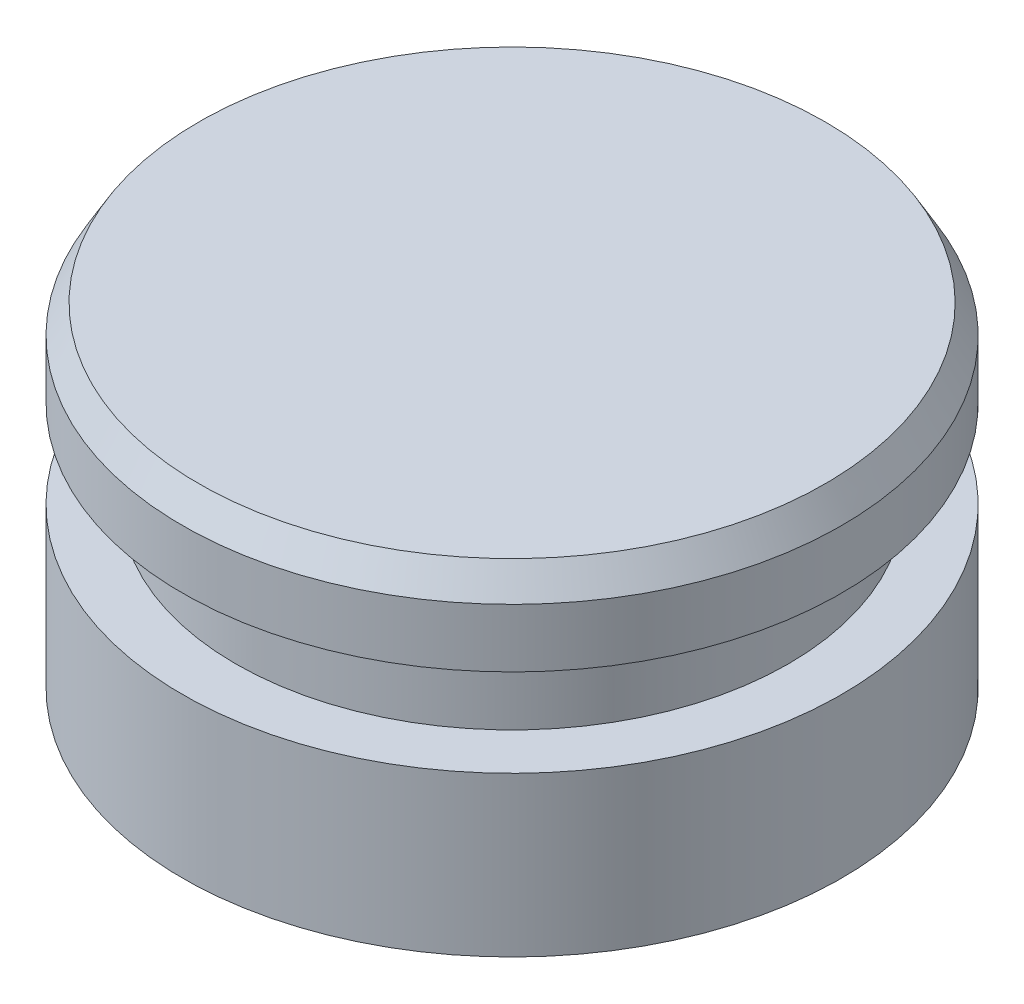
ISO-10303-21;
HEADER;
FILE_DESCRIPTION(('STEP AP214'),'2;1');
FILE_NAME('part.step','',(''),(''),'','','');
FILE_SCHEMA(('AUTOMOTIVE_DESIGN { 1 0 10303 214 1 1 1 1 }'));
ENDSEC;
DATA;
#1=APPLICATION_CONTEXT('core data for automotive mechanical design processes');
#2=APPLICATION_PROTOCOL_DEFINITION('international standard','automotive_design',2000,#1);
#3=PRODUCT_CONTEXT('',#1,'mechanical');
#4=PRODUCT('Part','Part','',(#3));
#5=PRODUCT_RELATED_PRODUCT_CATEGORY('part','',(#4));
#6=PRODUCT_DEFINITION_FORMATION('','',#4);
#7=PRODUCT_DEFINITION_CONTEXT('part definition',#1,'design');
#8=PRODUCT_DEFINITION('design','',#6,#7);
#9=PRODUCT_DEFINITION_SHAPE('','',#8);
#10=(LENGTH_UNIT() NAMED_UNIT(*) SI_UNIT(.MILLI.,.METRE.));
#11=(NAMED_UNIT(*) PLANE_ANGLE_UNIT() SI_UNIT($,.RADIAN.));
#12=(NAMED_UNIT(*) SI_UNIT($,.STERADIAN.) SOLID_ANGLE_UNIT());
#13=UNCERTAINTY_MEASURE_WITH_UNIT(LENGTH_MEASURE(1.E-05),#10,'distance_accuracy_value','');
#14=(GEOMETRIC_REPRESENTATION_CONTEXT(3) GLOBAL_UNCERTAINTY_ASSIGNED_CONTEXT((#13)) GLOBAL_UNIT_ASSIGNED_CONTEXT((#10,
#11,#12)) REPRESENTATION_CONTEXT('',''));
#15=CARTESIAN_POINT('',(0.,0.,0.));
#16=DIRECTION('',(0.,0.,1.));
#17=DIRECTION('',(1.,0.,0.));
#18=AXIS2_PLACEMENT_3D('',#15,#16,#17);
#19=CARTESIAN_POINT('',(0.,0.,0.));
#20=DIRECTION('',(0.,1.,0.));
#21=DIRECTION('',(0.,0.,1.));
#22=AXIS2_PLACEMENT_3D('',#19,#20,#21);
#23=PLANE('',#22);
#24=CARTESIAN_POINT('',(0.,0.,0.));
#25=DIRECTION('',(0.,-1.,0.));
#26=DIRECTION('',(0.,0.,-1.));
#27=AXIS2_PLACEMENT_3D('',#24,#25,#26);
#28=CIRCLE('',#27,9.5377);
#29=CARTESIAN_POINT('',(0.,0.,-9.5377));
#30=VERTEX_POINT('',#29);
#31=EDGE_CURVE('E43',#30,#30,#28,.T.);
#32=ORIENTED_EDGE('',*,*,#31,.T.);
#33=EDGE_LOOP('',(#32));
#34=FACE_BOUND('',#33,.T.);
#35=ADVANCED_FACE('F32',(#34),#23,.F.);
#36=CARTESIAN_POINT('',(0.,0.,0.));
#37=DIRECTION('',(0.,-1.,0.));
#38=DIRECTION('',(0.,0.,-1.));
#39=AXIS2_PLACEMENT_3D('',#36,#37,#38);
#40=CYLINDRICAL_SURFACE('',#39,9.5377);
#41=ORIENTED_EDGE('',*,*,#31,.F.);
#42=EDGE_LOOP('',(#41));
#43=FACE_BOUND('',#42,.T.);
#44=CARTESIAN_POINT('',(0.,4.60375,0.));
#45=DIRECTION('',(0.,-1.,0.));
#46=DIRECTION('',(0.,0.,-1.));
#47=AXIS2_PLACEMENT_3D('',#44,#45,#46);
#48=CIRCLE('',#47,9.5377);
#49=CARTESIAN_POINT('',(0.,4.60375,-9.5377));
#50=VERTEX_POINT('',#49);
#51=EDGE_CURVE('E47',#50,#50,#48,.T.);
#52=ORIENTED_EDGE('',*,*,#51,.T.);
#53=EDGE_LOOP('',(#52));
#54=FACE_BOUND('',#53,.T.);
#55=ADVANCED_FACE('F77',(#43,#54),#40,.T.);
#56=CARTESIAN_POINT('',(-8.001,4.60375,0.));
#57=DIRECTION('',(0.,-1.,0.));
#58=DIRECTION('',(0.,0.,-1.));
#59=AXIS2_PLACEMENT_3D('',#56,#57,#58);
#60=PLANE('',#59);
#61=ORIENTED_EDGE('',*,*,#51,.F.);
#62=EDGE_LOOP('',(#61));
#63=FACE_BOUND('',#62,.T.);
#64=CARTESIAN_POINT('',(0.,4.60375,0.));
#65=DIRECTION('',(0.,-1.,0.));
#66=DIRECTION('',(0.,0.,-1.));
#67=AXIS2_PLACEMENT_3D('',#64,#65,#66);
#68=CIRCLE('',#67,8.001);
#69=CARTESIAN_POINT('',(0.,4.60375,-8.001));
#70=VERTEX_POINT('',#69);
#71=EDGE_CURVE('E52',#70,#70,#68,.T.);
#72=ORIENTED_EDGE('',*,*,#71,.T.);
#73=EDGE_LOOP('',(#72));
#74=FACE_BOUND('',#73,.T.);
#75=ADVANCED_FACE('F82',(#63,#74),#60,.F.);
#76=CARTESIAN_POINT('',(0.,0.,0.));
#77=DIRECTION('',(0.,-1.,0.));
#78=DIRECTION('',(0.,0.,-1.));
#79=AXIS2_PLACEMENT_3D('',#76,#77,#78);
#80=CYLINDRICAL_SURFACE('',#79,8.001);
#81=ORIENTED_EDGE('',*,*,#71,.F.);
#82=EDGE_LOOP('',(#81));
#83=FACE_BOUND('',#82,.T.);
#84=CARTESIAN_POINT('',(0.,7.14375,0.));
#85=DIRECTION('',(0.,-1.,0.));
#86=DIRECTION('',(0.,0.,-1.));
#87=AXIS2_PLACEMENT_3D('',#84,#85,#86);
#88=CIRCLE('',#87,8.001);
#89=CARTESIAN_POINT('',(0.,7.14375,-8.001));
#90=VERTEX_POINT('',#89);
#91=EDGE_CURVE('E55',#90,#90,#88,.T.);
#92=ORIENTED_EDGE('',*,*,#91,.T.);
#93=EDGE_LOOP('',(#92));
#94=FACE_BOUND('',#93,.T.);
#95=ADVANCED_FACE('F73',(#83,#94),#80,.T.);
#96=CARTESIAN_POINT('',(-8.001,7.14375,0.));
#97=DIRECTION('',(0.,1.,0.));
#98=DIRECTION('',(0.,0.,1.));
#99=AXIS2_PLACEMENT_3D('',#96,#97,#98);
#100=PLANE('',#99);
#101=ORIENTED_EDGE('',*,*,#91,.F.);
#102=EDGE_LOOP('',(#101));
#103=FACE_BOUND('',#102,.T.);
#104=CARTESIAN_POINT('',(0.,7.14375,0.));
#105=DIRECTION('',(0.,-1.,0.));
#106=DIRECTION('',(0.,0.,-1.));
#107=AXIS2_PLACEMENT_3D('',#104,#105,#106);
#108=CIRCLE('',#107,9.5377);
#109=CARTESIAN_POINT('',(0.,7.14375,-9.5377));
#110=VERTEX_POINT('',#109);
#111=EDGE_CURVE('E58',#110,#110,#108,.T.);
#112=ORIENTED_EDGE('',*,*,#111,.T.);
#113=EDGE_LOOP('',(#112));
#114=FACE_BOUND('',#113,.T.);
#115=ADVANCED_FACE('F62',(#103,#114),#100,.F.);
#116=CARTESIAN_POINT('',(0.,0.,0.));
#117=DIRECTION('',(0.,-1.,0.));
#118=DIRECTION('',(0.,0.,-1.));
#119=AXIS2_PLACEMENT_3D('',#116,#117,#118);
#120=CYLINDRICAL_SURFACE('',#119,9.5377);
#121=CARTESIAN_POINT('',(0.,8.83729462014352,0.));
#122=DIRECTION('',(0.,-1.,0.));
#123=DIRECTION('',(0.,0.,-1.));
#124=AXIS2_PLACEMENT_3D('',#121,#122,#123);
#125=CIRCLE('',#124,9.5377);
#126=CARTESIAN_POINT('',(0.,8.83729462014352,-9.5377));
#127=VERTEX_POINT('',#126);
#128=EDGE_CURVE('E39',#127,#127,#125,.T.);
#129=ORIENTED_EDGE('',*,*,#128,.T.);
#130=EDGE_LOOP('',(#129));
#131=FACE_BOUND('',#130,.T.);
#132=ORIENTED_EDGE('',*,*,#111,.F.);
#133=EDGE_LOOP('',(#132));
#134=FACE_BOUND('',#133,.T.);
#135=ADVANCED_FACE('F64',(#131,#134),#120,.T.);
#136=CARTESIAN_POINT('',(-9.5377,9.652,0.));
#137=DIRECTION('',(0.,-1.,0.));
#138=DIRECTION('',(0.,0.,-1.));
#139=AXIS2_PLACEMENT_3D('',#136,#137,#138);
#140=PLANE('',#139);
#141=CARTESIAN_POINT('',(0.,9.652,0.));
#142=DIRECTION('',(0.,-1.,0.));
#143=DIRECTION('',(0.,0.,-1.));
#144=AXIS2_PLACEMENT_3D('',#141,#142,#143);
#145=CIRCLE('',#144,9.06732962962962);
#146=CARTESIAN_POINT('',(0.,9.652,-9.06732962962962));
#147=VERTEX_POINT('',#146);
#148=EDGE_CURVE('E10',#147,#147,#145,.F.);
#149=ORIENTED_EDGE('',*,*,#148,.T.);
#150=EDGE_LOOP('',(#149));
#151=FACE_BOUND('',#150,.T.);
#152=ADVANCED_FACE('F66',(#151),#140,.F.);
#153=CARTESIAN_POINT('',(0.,8.83729462014352,0.));
#154=DIRECTION('',(0.,-1.,0.));
#155=DIRECTION('',(0.,0.,-1.));
#156=AXIS2_PLACEMENT_3D('',#153,#154,#155);
#157=CONICAL_SURFACE('',#156,9.5377,0.523598775598303);
#158=ORIENTED_EDGE('',*,*,#148,.F.);
#159=EDGE_LOOP('',(#158));
#160=FACE_BOUND('',#159,.T.);
#161=ORIENTED_EDGE('',*,*,#128,.F.);
#162=EDGE_LOOP('',(#161));
#163=FACE_BOUND('',#162,.T.);
#164=ADVANCED_FACE('F34',(#160,#163),#157,.T.);
#165=CLOSED_SHELL('',(#35,#55,#75,#95,#115,#135,#152,#164));
#166=MANIFOLD_SOLID_BREP('B2',#165);
#167=ADVANCED_BREP_SHAPE_REPRESENTATION('',(#18,#166),#14);
#168=SHAPE_DEFINITION_REPRESENTATION(#9,#167);
ENDSEC;
END-ISO-10303-21;
